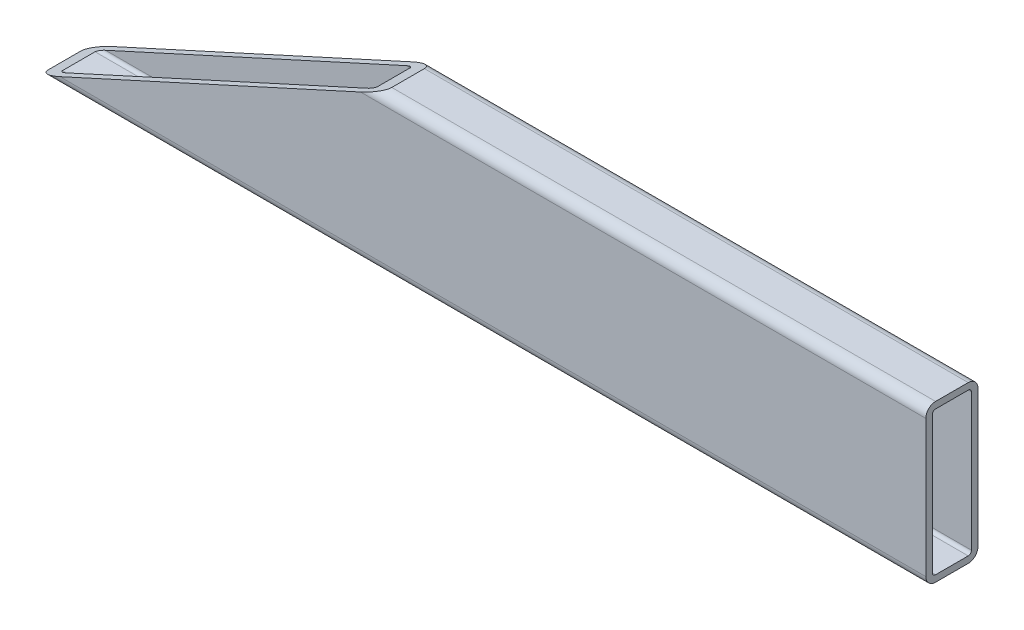
ISO-10303-21;
HEADER;
FILE_DESCRIPTION(('STEP AP214'),'2;1');
FILE_NAME('part.step','',(''),(''),'','','');
FILE_SCHEMA(('AUTOMOTIVE_DESIGN { 1 0 10303 214 1 1 1 1 }'));
ENDSEC;
DATA;
#1=APPLICATION_CONTEXT('core data for automotive mechanical design processes');
#2=APPLICATION_PROTOCOL_DEFINITION('international standard','automotive_design',2000,#1);
#3=PRODUCT_CONTEXT('',#1,'mechanical');
#4=PRODUCT('Part','Part','',(#3));
#5=PRODUCT_RELATED_PRODUCT_CATEGORY('part','',(#4));
#6=PRODUCT_DEFINITION_FORMATION('','',#4);
#7=PRODUCT_DEFINITION_CONTEXT('part definition',#1,'design');
#8=PRODUCT_DEFINITION('design','',#6,#7);
#9=PRODUCT_DEFINITION_SHAPE('','',#8);
#10=(LENGTH_UNIT() NAMED_UNIT(*) SI_UNIT(.MILLI.,.METRE.));
#11=(NAMED_UNIT(*) PLANE_ANGLE_UNIT() SI_UNIT($,.RADIAN.));
#12=(NAMED_UNIT(*) SI_UNIT($,.STERADIAN.) SOLID_ANGLE_UNIT());
#13=UNCERTAINTY_MEASURE_WITH_UNIT(LENGTH_MEASURE(1.E-05),#10,'distance_accuracy_value','');
#14=(GEOMETRIC_REPRESENTATION_CONTEXT(3) GLOBAL_UNCERTAINTY_ASSIGNED_CONTEXT((#13)) GLOBAL_UNIT_ASSIGNED_CONTEXT((#10,
#11,#12)) REPRESENTATION_CONTEXT('',''));
#15=CARTESIAN_POINT('',(0.,0.,0.));
#16=DIRECTION('',(0.,0.,1.));
#17=DIRECTION('',(1.,0.,0.));
#18=AXIS2_PLACEMENT_3D('',#15,#16,#17);
#19=CARTESIAN_POINT('',(-215.9,33.3375,7.93750000000006));
#20=DIRECTION('',(1.,0.,0.));
#21=DIRECTION('',(0.,0.,-1.));
#22=AXIS2_PLACEMENT_3D('',#19,#20,#21);
#23=CYLINDRICAL_SURFACE('',#22,4.7625);
#24=CARTESIAN_POINT('',(-59.1447129548995,33.3375,7.93750000000001));
#25=DIRECTION('',(-0.414693242656243,0.909961270876541,0.));
#26=DIRECTION('',(0.909961270876541,0.414693242656243,0.));
#27=AXIS2_PLACEMENT_3D('',#24,#25,#26);
#28=ELLIPSE('',#27,11.4843925825621,4.7625);
#29=CARTESIAN_POINT('',(-59.1447129548995,33.3375,12.7));
#30=VERTEX_POINT('',#29);
#31=CARTESIAN_POINT('',(-48.6943604852261,38.1,7.93750000000006));
#32=VERTEX_POINT('',#31);
#33=EDGE_CURVE('E240',#30,#32,#28,.T.);
#34=ORIENTED_EDGE('',*,*,#33,.F.);
#35=DIRECTION('',(1.,0.,0.));
#36=VECTOR('',#35,1.);
#37=CARTESIAN_POINT('',(-215.9,33.3375,12.7000000000001));
#38=LINE('',#37,#36);
#39=CARTESIAN_POINT('',(215.9,33.3375,12.6999999999999));
#40=VERTEX_POINT('',#39);
#41=EDGE_CURVE('E175',#30,#40,#38,.T.);
#42=ORIENTED_EDGE('',*,*,#41,.T.);
#43=CARTESIAN_POINT('',(215.9,33.3375,7.93749999999992));
#44=DIRECTION('',(-1.,0.,0.));
#45=DIRECTION('',(0.,0.,1.));
#46=AXIS2_PLACEMENT_3D('',#43,#44,#45);
#47=CIRCLE('',#46,4.7625);
#48=CARTESIAN_POINT('',(215.9,38.1,7.93749999999992));
#49=VERTEX_POINT('',#48);
#50=EDGE_CURVE('E189',#40,#49,#47,.T.);
#51=ORIENTED_EDGE('',*,*,#50,.T.);
#52=DIRECTION('',(1.,0.,0.));
#53=VECTOR('',#52,1.);
#54=CARTESIAN_POINT('',(-215.9,38.1,7.93750000000006));
#55=LINE('',#54,#53);
#56=EDGE_CURVE('E12',#32,#49,#55,.T.);
#57=ORIENTED_EDGE('',*,*,#56,.F.);
#58=EDGE_LOOP('',(#34,#42,#51,#57));
#59=FACE_BOUND('',#58,.T.);
#60=ADVANCED_FACE('F82',(#59),#23,.T.);
#61=CARTESIAN_POINT('',(-215.9,38.1,7.93750000000006));
#62=DIRECTION('',(0.,-1.,0.));
#63=DIRECTION('',(0.,0.,-1.));
#64=AXIS2_PLACEMENT_3D('',#61,#62,#63);
#65=PLANE('',#64);
#66=DIRECTION('',(0.,0.,1.));
#67=VECTOR('',#66,1.);
#68=CARTESIAN_POINT('',(-48.6943604852261,38.1,-12.7000000000001));
#69=LINE('',#68,#67);
#70=CARTESIAN_POINT('',(-48.6943604852261,38.1,-7.93749999999997));
#71=VERTEX_POINT('',#70);
#72=EDGE_CURVE('E337',#71,#32,#69,.T.);
#73=ORIENTED_EDGE('',*,*,#72,.T.);
#74=ORIENTED_EDGE('',*,*,#56,.T.);
#75=DIRECTION('',(0.,0.,-1.));
#76=VECTOR('',#75,1.);
#77=CARTESIAN_POINT('',(215.9,38.1,7.93749999999992));
#78=LINE('',#77,#76);
#79=CARTESIAN_POINT('',(215.9,38.1,-7.93750000000008));
#80=VERTEX_POINT('',#79);
#81=EDGE_CURVE('E261',#49,#80,#78,.T.);
#82=ORIENTED_EDGE('',*,*,#81,.T.);
#83=DIRECTION('',(1.,0.,0.));
#84=VECTOR('',#83,1.);
#85=CARTESIAN_POINT('',(-215.9,38.1,-7.93749999999994));
#86=LINE('',#85,#84);
#87=EDGE_CURVE('E91',#71,#80,#86,.T.);
#88=ORIENTED_EDGE('',*,*,#87,.F.);
#89=EDGE_LOOP('',(#73,#74,#82,#88));
#90=FACE_BOUND('',#89,.T.);
#91=ADVANCED_FACE('F339',(#90),#65,.F.);
#92=CARTESIAN_POINT('',(-215.9,33.3375,-7.93749999999994));
#93=DIRECTION('',(1.,0.,0.));
#94=DIRECTION('',(0.,0.,-1.));
#95=AXIS2_PLACEMENT_3D('',#92,#93,#94);
#96=CYLINDRICAL_SURFACE('',#95,4.7625);
#97=CARTESIAN_POINT('',(-59.1447129548995,33.3375,-7.93749999999999));
#98=DIRECTION('',(-0.414693242656243,0.909961270876541,0.));
#99=DIRECTION('',(0.909961270876541,0.414693242656243,0.));
#100=AXIS2_PLACEMENT_3D('',#97,#98,#99);
#101=ELLIPSE('',#100,11.4843925825621,4.7625);
#102=CARTESIAN_POINT('',(-59.1447129548995,33.3375,-12.7000000000001));
#103=VERTEX_POINT('',#102);
#104=EDGE_CURVE('E331',#71,#103,#101,.T.);
#105=ORIENTED_EDGE('',*,*,#104,.F.);
#106=ORIENTED_EDGE('',*,*,#87,.T.);
#107=CARTESIAN_POINT('',(215.9,33.3375,-7.93750000000008));
#108=DIRECTION('',(-1.,0.,0.));
#109=DIRECTION('',(0.,0.,1.));
#110=AXIS2_PLACEMENT_3D('',#107,#108,#109);
#111=CIRCLE('',#110,4.7625);
#112=CARTESIAN_POINT('',(215.9,33.3375,-12.7000000000001));
#113=VERTEX_POINT('',#112);
#114=EDGE_CURVE('E264',#80,#113,#111,.T.);
#115=ORIENTED_EDGE('',*,*,#114,.T.);
#116=DIRECTION('',(1.,0.,0.));
#117=VECTOR('',#116,1.);
#118=CARTESIAN_POINT('',(-215.9,33.3375,-12.6999999999999));
#119=LINE('',#118,#117);
#120=EDGE_CURVE('E203',#103,#113,#119,.T.);
#121=ORIENTED_EDGE('',*,*,#120,.F.);
#122=EDGE_LOOP('',(#105,#106,#115,#121));
#123=FACE_BOUND('',#122,.T.);
#124=ADVANCED_FACE('F290',(#123),#96,.T.);
#125=CARTESIAN_POINT('',(-215.9,-33.3375,-12.6999999999999));
#126=DIRECTION('',(0.,0.,1.));
#127=DIRECTION('',(1.,0.,0.));
#128=AXIS2_PLACEMENT_3D('',#125,#126,#127);
#129=PLANE('',#128);
#130=DIRECTION('',(-0.909961270876541,-0.414693242656243,0.));
#131=VECTOR('',#130,1.);
#132=CARTESIAN_POINT('',(-22.7512103172316,49.9229746827799,-12.7000000000001));
#133=LINE('',#132,#131);
#134=CARTESIAN_POINT('',(-205.449647530327,-33.3375,-12.7));
#135=VERTEX_POINT('',#134);
#136=EDGE_CURVE('E287',#103,#135,#133,.T.);
#137=ORIENTED_EDGE('',*,*,#136,.F.);
#138=ORIENTED_EDGE('',*,*,#120,.T.);
#139=DIRECTION('',(0.,-1.,0.));
#140=VECTOR('',#139,1.);
#141=CARTESIAN_POINT('',(215.9,-33.3375,-12.7000000000001));
#142=LINE('',#141,#140);
#143=CARTESIAN_POINT('',(215.9,-33.3375,-12.7000000000001));
#144=VERTEX_POINT('',#143);
#145=EDGE_CURVE('E267',#113,#144,#142,.T.);
#146=ORIENTED_EDGE('',*,*,#145,.T.);
#147=DIRECTION('',(1.,0.,0.));
#148=VECTOR('',#147,1.);
#149=CARTESIAN_POINT('',(-215.9,-33.3375,-12.6999999999999));
#150=LINE('',#149,#148);
#151=EDGE_CURVE('E201',#135,#144,#150,.T.);
#152=ORIENTED_EDGE('',*,*,#151,.F.);
#153=EDGE_LOOP('',(#137,#138,#146,#152));
#154=FACE_BOUND('',#153,.T.);
#155=ADVANCED_FACE('F284',(#154),#129,.F.);
#156=CARTESIAN_POINT('',(-215.9,-33.3375,-7.93749999999994));
#157=DIRECTION('',(1.,0.,0.));
#158=DIRECTION('',(0.,0.,-1.));
#159=AXIS2_PLACEMENT_3D('',#156,#157,#158);
#160=CYLINDRICAL_SURFACE('',#159,4.7625);
#161=CARTESIAN_POINT('',(-205.449647530327,-33.3375,-7.93749999999995));
#162=DIRECTION('',(-0.414693242656243,0.909961270876541,0.));
#163=DIRECTION('',(0.909961270876541,0.414693242656243,0.));
#164=AXIS2_PLACEMENT_3D('',#161,#162,#163);
#165=ELLIPSE('',#164,11.4843925825621,4.7625);
#166=CARTESIAN_POINT('',(-215.9,-38.1,-7.93749999999994));
#167=VERTEX_POINT('',#166);
#168=EDGE_CURVE('E108',#135,#167,#165,.T.);
#169=ORIENTED_EDGE('',*,*,#168,.F.);
#170=ORIENTED_EDGE('',*,*,#151,.T.);
#171=CARTESIAN_POINT('',(215.9,-33.3375,-7.93750000000008));
#172=DIRECTION('',(-1.,0.,0.));
#173=DIRECTION('',(0.,0.,1.));
#174=AXIS2_PLACEMENT_3D('',#171,#172,#173);
#175=CIRCLE('',#174,4.7625);
#176=CARTESIAN_POINT('',(215.9,-38.1,-7.93750000000008));
#177=VERTEX_POINT('',#176);
#178=EDGE_CURVE('E270',#144,#177,#175,.T.);
#179=ORIENTED_EDGE('',*,*,#178,.T.);
#180=DIRECTION('',(1.,0.,0.));
#181=VECTOR('',#180,1.);
#182=CARTESIAN_POINT('',(-215.9,-38.1,-7.93749999999994));
#183=LINE('',#182,#181);
#184=EDGE_CURVE('E198',#167,#177,#183,.T.);
#185=ORIENTED_EDGE('',*,*,#184,.F.);
#186=EDGE_LOOP('',(#169,#170,#179,#185));
#187=FACE_BOUND('',#186,.T.);
#188=ADVANCED_FACE('F279',(#187),#160,.T.);
#189=CARTESIAN_POINT('',(-215.9,-33.3375,7.93750000000006));
#190=DIRECTION('',(1.,0.,0.));
#191=DIRECTION('',(0.,0.,-1.));
#192=AXIS2_PLACEMENT_3D('',#189,#190,#191);
#193=CYLINDRICAL_SURFACE('',#192,4.7625);
#194=CARTESIAN_POINT('',(-205.449647530327,-33.3375,7.93750000000005));
#195=DIRECTION('',(-0.414693242656243,0.909961270876541,0.));
#196=DIRECTION('',(0.909961270876541,0.414693242656243,0.));
#197=AXIS2_PLACEMENT_3D('',#194,#195,#196);
#198=ELLIPSE('',#197,11.4843925825621,4.7625);
#199=CARTESIAN_POINT('',(-215.9,-38.1,7.93750000000006));
#200=VERTEX_POINT('',#199);
#201=CARTESIAN_POINT('',(-205.449647530327,-33.3375,12.7));
#202=VERTEX_POINT('',#201);
#203=EDGE_CURVE('E323',#200,#202,#198,.T.);
#204=ORIENTED_EDGE('',*,*,#203,.F.);
#205=DIRECTION('',(1.,0.,0.));
#206=VECTOR('',#205,1.);
#207=CARTESIAN_POINT('',(-215.9,-38.1,7.93750000000005));
#208=LINE('',#207,#206);
#209=CARTESIAN_POINT('',(215.9,-38.1,7.93749999999992));
#210=VERTEX_POINT('',#209);
#211=EDGE_CURVE('E174',#200,#210,#208,.T.);
#212=ORIENTED_EDGE('',*,*,#211,.T.);
#213=CARTESIAN_POINT('',(215.9,-33.3375,7.93749999999992));
#214=DIRECTION('',(-1.,0.,0.));
#215=DIRECTION('',(0.,0.,1.));
#216=AXIS2_PLACEMENT_3D('',#213,#214,#215);
#217=CIRCLE('',#216,4.7625);
#218=CARTESIAN_POINT('',(215.9,-33.3375,12.6999999999999));
#219=VERTEX_POINT('',#218);
#220=EDGE_CURVE('E179',#210,#219,#217,.T.);
#221=ORIENTED_EDGE('',*,*,#220,.T.);
#222=DIRECTION('',(1.,0.,0.));
#223=VECTOR('',#222,1.);
#224=CARTESIAN_POINT('',(-215.9,-33.3375,12.7000000000001));
#225=LINE('',#224,#223);
#226=EDGE_CURVE('E162',#202,#219,#225,.T.);
#227=ORIENTED_EDGE('',*,*,#226,.F.);
#228=EDGE_LOOP('',(#204,#212,#221,#227));
#229=FACE_BOUND('',#228,.T.);
#230=ADVANCED_FACE('F180',(#229),#193,.T.);
#231=CARTESIAN_POINT('',(-215.9,33.3375,-7.93749999999994));
#232=DIRECTION('',(1.,0.,0.));
#233=DIRECTION('',(0.,0.,-1.));
#234=AXIS2_PLACEMENT_3D('',#231,#232,#233);
#235=CYLINDRICAL_SURFACE('',#234,1.5875);
#236=DIRECTION('',(1.,0.,0.));
#237=VECTOR('',#236,1.);
#238=CARTESIAN_POINT('',(-215.9,34.925,-7.93749999999994));
#239=LINE('',#238,#237);
#240=CARTESIAN_POINT('',(-55.6612621316751,34.925,-7.93750000000008));
#241=VERTEX_POINT('',#240);
#242=CARTESIAN_POINT('',(215.9,34.925,-7.93750000000008));
#243=VERTEX_POINT('',#242);
#244=EDGE_CURVE('E86',#241,#243,#239,.T.);
#245=ORIENTED_EDGE('',*,*,#244,.F.);
#246=CARTESIAN_POINT('',(-59.1447129548995,33.3375,-7.93749999999999));
#247=DIRECTION('',(-0.414693242656243,0.909961270876541,0.));
#248=DIRECTION('',(0.909961270876541,0.414693242656243,0.));
#249=AXIS2_PLACEMENT_3D('',#246,#247,#248);
#250=ELLIPSE('',#249,3.82813086085404,1.5875);
#251=CARTESIAN_POINT('',(-59.1447129548995,33.3375,-9.52499999999999));
#252=VERTEX_POINT('',#251);
#253=EDGE_CURVE('E320',#241,#252,#250,.T.);
#254=ORIENTED_EDGE('',*,*,#253,.T.);
#255=DIRECTION('',(1.,0.,0.));
#256=VECTOR('',#255,1.);
#257=CARTESIAN_POINT('',(-215.9,33.3375,-9.52499999999994));
#258=LINE('',#257,#256);
#259=CARTESIAN_POINT('',(215.9,33.3375,-9.52500000000007));
#260=VERTEX_POINT('',#259);
#261=EDGE_CURVE('E192',#252,#260,#258,.T.);
#262=ORIENTED_EDGE('',*,*,#261,.T.);
#263=CARTESIAN_POINT('',(215.9,33.3375,-7.93750000000008));
#264=DIRECTION('',(-1.,0.,0.));
#265=DIRECTION('',(0.,0.,1.));
#266=AXIS2_PLACEMENT_3D('',#263,#264,#265);
#267=CIRCLE('',#266,1.5875);
#268=EDGE_CURVE('E235',#243,#260,#267,.T.);
#269=ORIENTED_EDGE('',*,*,#268,.F.);
#270=EDGE_LOOP('',(#245,#254,#262,#269));
#271=FACE_BOUND('',#270,.T.);
#272=ADVANCED_FACE('F84',(#271),#235,.F.);
#273=CARTESIAN_POINT('',(-215.9,34.925,7.93750000000006));
#274=DIRECTION('',(0.,-1.,0.));
#275=DIRECTION('',(0.,0.,-1.));
#276=AXIS2_PLACEMENT_3D('',#273,#274,#275);
#277=PLANE('',#276);
#278=DIRECTION('',(1.,0.,0.));
#279=VECTOR('',#278,1.);
#280=CARTESIAN_POINT('',(-215.9,34.925,7.93750000000006));
#281=LINE('',#280,#279);
#282=CARTESIAN_POINT('',(-55.6612621316751,34.925,7.93750000000001));
#283=VERTEX_POINT('',#282);
#284=CARTESIAN_POINT('',(215.9,34.925,7.93749999999992));
#285=VERTEX_POINT('',#284);
#286=EDGE_CURVE('E216',#283,#285,#281,.T.);
#287=ORIENTED_EDGE('',*,*,#286,.F.);
#288=DIRECTION('',(0.,0.,-1.));
#289=VECTOR('',#288,1.);
#290=CARTESIAN_POINT('',(-55.6612621316751,34.925,7.93750000000006));
#291=LINE('',#290,#289);
#292=EDGE_CURVE('E231',#283,#241,#291,.T.);
#293=ORIENTED_EDGE('',*,*,#292,.T.);
#294=ORIENTED_EDGE('',*,*,#244,.T.);
#295=DIRECTION('',(0.,0.,-1.));
#296=VECTOR('',#295,1.);
#297=CARTESIAN_POINT('',(215.9,34.925,7.93749999999992));
#298=LINE('',#297,#296);
#299=EDGE_CURVE('E228',#285,#243,#298,.T.);
#300=ORIENTED_EDGE('',*,*,#299,.F.);
#301=EDGE_LOOP('',(#287,#293,#294,#300));
#302=FACE_BOUND('',#301,.T.);
#303=ADVANCED_FACE('F226',(#302),#277,.T.);
#304=CARTESIAN_POINT('',(-215.9,33.3375,7.93750000000006));
#305=DIRECTION('',(1.,0.,0.));
#306=DIRECTION('',(0.,0.,-1.));
#307=AXIS2_PLACEMENT_3D('',#304,#305,#306);
#308=CYLINDRICAL_SURFACE('',#307,1.5875);
#309=DIRECTION('',(1.,0.,0.));
#310=VECTOR('',#309,1.);
#311=CARTESIAN_POINT('',(-215.9,33.3375,9.52500000000005));
#312=LINE('',#311,#310);
#313=CARTESIAN_POINT('',(-59.1447129548995,33.3375,9.525));
#314=VERTEX_POINT('',#313);
#315=CARTESIAN_POINT('',(215.9,33.3375,9.52499999999992));
#316=VERTEX_POINT('',#315);
#317=EDGE_CURVE('E215',#314,#316,#312,.T.);
#318=ORIENTED_EDGE('',*,*,#317,.F.);
#319=CARTESIAN_POINT('',(-59.1447129548995,33.3375,7.93750000000001));
#320=DIRECTION('',(-0.414693242656243,0.909961270876541,0.));
#321=DIRECTION('',(0.909961270876541,0.414693242656243,0.));
#322=AXIS2_PLACEMENT_3D('',#319,#320,#321);
#323=ELLIPSE('',#322,3.82813086085404,1.5875);
#324=EDGE_CURVE('E326',#314,#283,#323,.T.);
#325=ORIENTED_EDGE('',*,*,#324,.T.);
#326=ORIENTED_EDGE('',*,*,#286,.T.);
#327=CARTESIAN_POINT('',(215.9,33.3375,7.93749999999992));
#328=DIRECTION('',(-1.,0.,0.));
#329=DIRECTION('',(0.,0.,1.));
#330=AXIS2_PLACEMENT_3D('',#327,#328,#329);
#331=CIRCLE('',#330,1.5875);
#332=EDGE_CURVE('E243',#316,#285,#331,.T.);
#333=ORIENTED_EDGE('',*,*,#332,.F.);
#334=EDGE_LOOP('',(#318,#325,#326,#333));
#335=FACE_BOUND('',#334,.T.);
#336=ADVANCED_FACE('F355',(#335),#308,.F.);
#337=CARTESIAN_POINT('',(-215.9,33.3375,9.52500000000005));
#338=DIRECTION('',(0.,0.,-1.));
#339=DIRECTION('',(-1.,0.,0.));
#340=AXIS2_PLACEMENT_3D('',#337,#338,#339);
#341=PLANE('',#340);
#342=DIRECTION('',(1.,0.,0.));
#343=VECTOR('',#342,1.);
#344=CARTESIAN_POINT('',(-215.9,-33.3375,9.52500000000005));
#345=LINE('',#344,#343);
#346=CARTESIAN_POINT('',(-205.449647530327,-33.3375,9.52500000000005));
#347=VERTEX_POINT('',#346);
#348=CARTESIAN_POINT('',(215.9,-33.3375,9.52499999999992));
#349=VERTEX_POINT('',#348);
#350=EDGE_CURVE('E213',#347,#349,#345,.T.);
#351=ORIENTED_EDGE('',*,*,#350,.F.);
#352=DIRECTION('',(0.909961270876541,0.414693242656243,0.));
#353=VECTOR('',#352,1.);
#354=CARTESIAN_POINT('',(-188.942717181418,-25.8148584417544,9.52500000000004));
#355=LINE('',#354,#353);
#356=EDGE_CURVE('E352',#347,#314,#355,.T.);
#357=ORIENTED_EDGE('',*,*,#356,.T.);
#358=ORIENTED_EDGE('',*,*,#317,.T.);
#359=DIRECTION('',(0.,1.,0.));
#360=VECTOR('',#359,1.);
#361=CARTESIAN_POINT('',(215.9,33.3375,9.52499999999992));
#362=LINE('',#361,#360);
#363=EDGE_CURVE('E245',#349,#316,#362,.T.);
#364=ORIENTED_EDGE('',*,*,#363,.F.);
#365=EDGE_LOOP('',(#351,#357,#358,#364));
#366=FACE_BOUND('',#365,.T.);
#367=ADVANCED_FACE('F358',(#366),#341,.T.);
#368=CARTESIAN_POINT('',(-215.9,-33.3375,7.93750000000006));
#369=DIRECTION('',(1.,0.,0.));
#370=DIRECTION('',(0.,0.,-1.));
#371=AXIS2_PLACEMENT_3D('',#368,#369,#370);
#372=CYLINDRICAL_SURFACE('',#371,1.5875);
#373=DIRECTION('',(1.,0.,0.));
#374=VECTOR('',#373,1.);
#375=CARTESIAN_POINT('',(-215.9,-34.925,7.93750000000006));
#376=LINE('',#375,#374);
#377=CARTESIAN_POINT('',(-208.933098353551,-34.925,7.93750000000006));
#378=VERTEX_POINT('',#377);
#379=CARTESIAN_POINT('',(215.9,-34.925,7.93749999999992));
#380=VERTEX_POINT('',#379);
#381=EDGE_CURVE('E211',#378,#380,#376,.T.);
#382=ORIENTED_EDGE('',*,*,#381,.F.);
#383=CARTESIAN_POINT('',(-205.449647530327,-33.3375,7.93750000000005));
#384=DIRECTION('',(-0.414693242656243,0.909961270876541,0.));
#385=DIRECTION('',(0.909961270876541,0.414693242656243,0.));
#386=AXIS2_PLACEMENT_3D('',#383,#384,#385);
#387=ELLIPSE('',#386,3.82813086085404,1.5875);
#388=EDGE_CURVE('E349',#378,#347,#387,.T.);
#389=ORIENTED_EDGE('',*,*,#388,.T.);
#390=ORIENTED_EDGE('',*,*,#350,.T.);
#391=CARTESIAN_POINT('',(215.9,-33.3375,7.93749999999992));
#392=DIRECTION('',(-1.,0.,0.));
#393=DIRECTION('',(0.,0.,1.));
#394=AXIS2_PLACEMENT_3D('',#391,#392,#393);
#395=CIRCLE('',#394,1.5875);
#396=EDGE_CURVE('E249',#380,#349,#395,.T.);
#397=ORIENTED_EDGE('',*,*,#396,.F.);
#398=EDGE_LOOP('',(#382,#389,#390,#397));
#399=FACE_BOUND('',#398,.T.);
#400=ADVANCED_FACE('F363',(#399),#372,.F.);
#401=CARTESIAN_POINT('',(-215.9,-34.925,-7.93749999999994));
#402=DIRECTION('',(0.,1.,0.));
#403=DIRECTION('',(0.,0.,1.));
#404=AXIS2_PLACEMENT_3D('',#401,#402,#403);
#405=PLANE('',#404);
#406=DIRECTION('',(1.,0.,0.));
#407=VECTOR('',#406,1.);
#408=CARTESIAN_POINT('',(-215.9,-34.925,-7.93749999999994));
#409=LINE('',#408,#407);
#410=CARTESIAN_POINT('',(-208.933098353551,-34.925,-7.93749999999995));
#411=VERTEX_POINT('',#410);
#412=CARTESIAN_POINT('',(215.9,-34.925,-7.93750000000008));
#413=VERTEX_POINT('',#412);
#414=EDGE_CURVE('E209',#411,#413,#409,.T.);
#415=ORIENTED_EDGE('',*,*,#414,.F.);
#416=DIRECTION('',(0.,0.,1.));
#417=VECTOR('',#416,1.);
#418=CARTESIAN_POINT('',(-208.933098353551,-34.925,-7.93749999999994));
#419=LINE('',#418,#417);
#420=EDGE_CURVE('E346',#411,#378,#419,.T.);
#421=ORIENTED_EDGE('',*,*,#420,.T.);
#422=ORIENTED_EDGE('',*,*,#381,.T.);
#423=DIRECTION('',(0.,0.,1.));
#424=VECTOR('',#423,1.);
#425=CARTESIAN_POINT('',(215.9,-34.925,-7.93750000000008));
#426=LINE('',#425,#424);
#427=EDGE_CURVE('E252',#413,#380,#426,.T.);
#428=ORIENTED_EDGE('',*,*,#427,.F.);
#429=EDGE_LOOP('',(#415,#421,#422,#428));
#430=FACE_BOUND('',#429,.T.);
#431=ADVANCED_FACE('F366',(#430),#405,.T.);
#432=CARTESIAN_POINT('',(-215.9,-33.3375,-7.93749999999994));
#433=DIRECTION('',(1.,0.,0.));
#434=DIRECTION('',(0.,0.,-1.));
#435=AXIS2_PLACEMENT_3D('',#432,#433,#434);
#436=CYLINDRICAL_SURFACE('',#435,1.5875);
#437=DIRECTION('',(1.,0.,0.));
#438=VECTOR('',#437,1.);
#439=CARTESIAN_POINT('',(-215.9,-33.3375,-9.52499999999994));
#440=LINE('',#439,#438);
#441=CARTESIAN_POINT('',(-205.449647530327,-33.3375,-9.52499999999995));
#442=VERTEX_POINT('',#441);
#443=CARTESIAN_POINT('',(215.9,-33.3375,-9.52500000000007));
#444=VERTEX_POINT('',#443);
#445=EDGE_CURVE('E207',#442,#444,#440,.T.);
#446=ORIENTED_EDGE('',*,*,#445,.F.);
#447=CARTESIAN_POINT('',(-205.449647530327,-33.3375,-7.93749999999995));
#448=DIRECTION('',(-0.414693242656243,0.909961270876541,0.));
#449=DIRECTION('',(0.909961270876541,0.414693242656243,0.));
#450=AXIS2_PLACEMENT_3D('',#447,#448,#449);
#451=ELLIPSE('',#450,3.82813086085404,1.5875);
#452=EDGE_CURVE('E99',#442,#411,#451,.T.);
#453=ORIENTED_EDGE('',*,*,#452,.T.);
#454=ORIENTED_EDGE('',*,*,#414,.T.);
#455=CARTESIAN_POINT('',(215.9,-33.3375,-7.93750000000008));
#456=DIRECTION('',(-1.,0.,0.));
#457=DIRECTION('',(0.,0.,1.));
#458=AXIS2_PLACEMENT_3D('',#455,#456,#457);
#459=CIRCLE('',#458,1.5875);
#460=EDGE_CURVE('E255',#444,#413,#459,.T.);
#461=ORIENTED_EDGE('',*,*,#460,.F.);
#462=EDGE_LOOP('',(#446,#453,#454,#461));
#463=FACE_BOUND('',#462,.T.);
#464=ADVANCED_FACE('F371',(#463),#436,.F.);
#465=CARTESIAN_POINT('',(-215.9,-33.3375,-9.52499999999994));
#466=DIRECTION('',(0.,0.,1.));
#467=DIRECTION('',(1.,0.,0.));
#468=AXIS2_PLACEMENT_3D('',#465,#466,#467);
#469=PLANE('',#468);
#470=ORIENTED_EDGE('',*,*,#261,.F.);
#471=DIRECTION('',(-0.909961270876541,-0.414693242656243,0.));
#472=VECTOR('',#471,1.);
#473=CARTESIAN_POINT('',(-214.102847812094,-37.2809905627836,-9.52499999999994));
#474=LINE('',#473,#472);
#475=EDGE_CURVE('E322',#252,#442,#474,.T.);
#476=ORIENTED_EDGE('',*,*,#475,.T.);
#477=ORIENTED_EDGE('',*,*,#445,.T.);
#478=DIRECTION('',(0.,-1.,0.));
#479=VECTOR('',#478,1.);
#480=CARTESIAN_POINT('',(215.9,-33.3375,-9.52500000000007));
#481=LINE('',#480,#479);
#482=EDGE_CURVE('E258',#260,#444,#481,.T.);
#483=ORIENTED_EDGE('',*,*,#482,.F.);
#484=EDGE_LOOP('',(#470,#476,#477,#483));
#485=FACE_BOUND('',#484,.T.);
#486=ADVANCED_FACE('F373',(#485),#469,.T.);
#487=CARTESIAN_POINT('',(-215.9,33.3375,12.7000000000001));
#488=DIRECTION('',(0.,0.,-1.));
#489=DIRECTION('',(-1.,0.,0.));
#490=AXIS2_PLACEMENT_3D('',#487,#488,#489);
#491=PLANE('',#490);
#492=DIRECTION('',(-0.909961270876541,-0.414693242656243,0.));
#493=VECTOR('',#492,1.);
#494=CARTESIAN_POINT('',(-22.7512103172316,49.9229746827799,12.7));
#495=LINE('',#494,#493);
#496=EDGE_CURVE('E171',#30,#202,#495,.T.);
#497=ORIENTED_EDGE('',*,*,#496,.T.);
#498=ORIENTED_EDGE('',*,*,#226,.T.);
#499=DIRECTION('',(0.,1.,0.));
#500=VECTOR('',#499,1.);
#501=CARTESIAN_POINT('',(215.9,33.3375,12.6999999999999));
#502=LINE('',#501,#500);
#503=EDGE_CURVE('E167',#219,#40,#502,.T.);
#504=ORIENTED_EDGE('',*,*,#503,.T.);
#505=ORIENTED_EDGE('',*,*,#41,.F.);
#506=EDGE_LOOP('',(#497,#498,#504,#505));
#507=FACE_BOUND('',#506,.T.);
#508=ADVANCED_FACE('F164',(#507),#491,.F.);
#509=CARTESIAN_POINT('',(-215.9,-38.1,-7.93749999999994));
#510=DIRECTION('',(0.,1.,0.));
#511=DIRECTION('',(0.,0.,1.));
#512=AXIS2_PLACEMENT_3D('',#509,#510,#511);
#513=PLANE('',#512);
#514=DIRECTION('',(0.,0.,1.));
#515=VECTOR('',#514,1.);
#516=CARTESIAN_POINT('',(215.9,-38.1,-7.93750000000008));
#517=LINE('',#516,#515);
#518=EDGE_CURVE('E184',#177,#210,#517,.T.);
#519=ORIENTED_EDGE('',*,*,#518,.T.);
#520=ORIENTED_EDGE('',*,*,#211,.F.);
#521=DIRECTION('',(0.,0.,1.));
#522=VECTOR('',#521,1.);
#523=CARTESIAN_POINT('',(-215.9,-38.1,-7.93749999999994));
#524=LINE('',#523,#522);
#525=EDGE_CURVE('E190',#167,#200,#524,.T.);
#526=ORIENTED_EDGE('',*,*,#525,.F.);
#527=ORIENTED_EDGE('',*,*,#184,.T.);
#528=EDGE_LOOP('',(#519,#520,#526,#527));
#529=FACE_BOUND('',#528,.T.);
#530=ADVANCED_FACE('F272',(#529),#513,.F.);
#531=CARTESIAN_POINT('',(215.9,33.3375,7.93749999999992));
#532=DIRECTION('',(-1.,0.,0.));
#533=DIRECTION('',(0.,0.,1.));
#534=AXIS2_PLACEMENT_3D('',#531,#532,#533);
#535=PLANE('',#534);
#536=ORIENTED_EDGE('',*,*,#268,.T.);
#537=ORIENTED_EDGE('',*,*,#482,.T.);
#538=ORIENTED_EDGE('',*,*,#460,.T.);
#539=ORIENTED_EDGE('',*,*,#427,.T.);
#540=ORIENTED_EDGE('',*,*,#396,.T.);
#541=ORIENTED_EDGE('',*,*,#363,.T.);
#542=ORIENTED_EDGE('',*,*,#332,.T.);
#543=ORIENTED_EDGE('',*,*,#299,.T.);
#544=EDGE_LOOP('',(#536,#537,#538,#539,#540,#541,#542,#543));
#545=FACE_BOUND('',#544,.T.);
#546=ORIENTED_EDGE('',*,*,#50,.F.);
#547=ORIENTED_EDGE('',*,*,#503,.F.);
#548=ORIENTED_EDGE('',*,*,#220,.F.);
#549=ORIENTED_EDGE('',*,*,#518,.F.);
#550=ORIENTED_EDGE('',*,*,#178,.F.);
#551=ORIENTED_EDGE('',*,*,#145,.F.);
#552=ORIENTED_EDGE('',*,*,#114,.F.);
#553=ORIENTED_EDGE('',*,*,#81,.F.);
#554=EDGE_LOOP('',(#546,#547,#548,#549,#550,#551,#552,#553));
#555=FACE_BOUND('',#554,.T.);
#556=ADVANCED_FACE('F186',(#545,#555),#535,.F.);
#557=CARTESIAN_POINT('',(-22.7512103172316,49.9229746827799,-12.7000000000001));
#558=DIRECTION('',(-0.414693242656243,0.909961270876541,0.));
#559=DIRECTION('',(-0.909961270876541,-0.414693242656243,0.));
#560=AXIS2_PLACEMENT_3D('',#557,#558,#559);
#561=PLANE('',#560);
#562=ORIENTED_EDGE('',*,*,#292,.F.);
#563=ORIENTED_EDGE('',*,*,#324,.F.);
#564=ORIENTED_EDGE('',*,*,#356,.F.);
#565=ORIENTED_EDGE('',*,*,#388,.F.);
#566=ORIENTED_EDGE('',*,*,#420,.F.);
#567=ORIENTED_EDGE('',*,*,#452,.F.);
#568=ORIENTED_EDGE('',*,*,#475,.F.);
#569=ORIENTED_EDGE('',*,*,#253,.F.);
#570=EDGE_LOOP('',(#562,#563,#564,#565,#566,#567,#568,#569));
#571=FACE_BOUND('',#570,.T.);
#572=ORIENTED_EDGE('',*,*,#33,.T.);
#573=ORIENTED_EDGE('',*,*,#72,.F.);
#574=ORIENTED_EDGE('',*,*,#104,.T.);
#575=ORIENTED_EDGE('',*,*,#136,.T.);
#576=ORIENTED_EDGE('',*,*,#168,.T.);
#577=ORIENTED_EDGE('',*,*,#525,.T.);
#578=ORIENTED_EDGE('',*,*,#203,.T.);
#579=ORIENTED_EDGE('',*,*,#496,.F.);
#580=EDGE_LOOP('',(#572,#573,#574,#575,#576,#577,#578,#579));
#581=FACE_BOUND('',#580,.T.);
#582=ADVANCED_FACE('F321',(#571,#581),#561,.T.);
#583=CLOSED_SHELL('',(#60,#91,#124,#155,#188,#230,#272,#303,#336,#367,#400,#431,#464,#486,#508,
#530,#556,#582));
#584=MANIFOLD_SOLID_BREP('B2',#583);
#585=ADVANCED_BREP_SHAPE_REPRESENTATION('',(#18,#584),#14);
#586=SHAPE_DEFINITION_REPRESENTATION(#9,#585);
ENDSEC;
END-ISO-10303-21;
